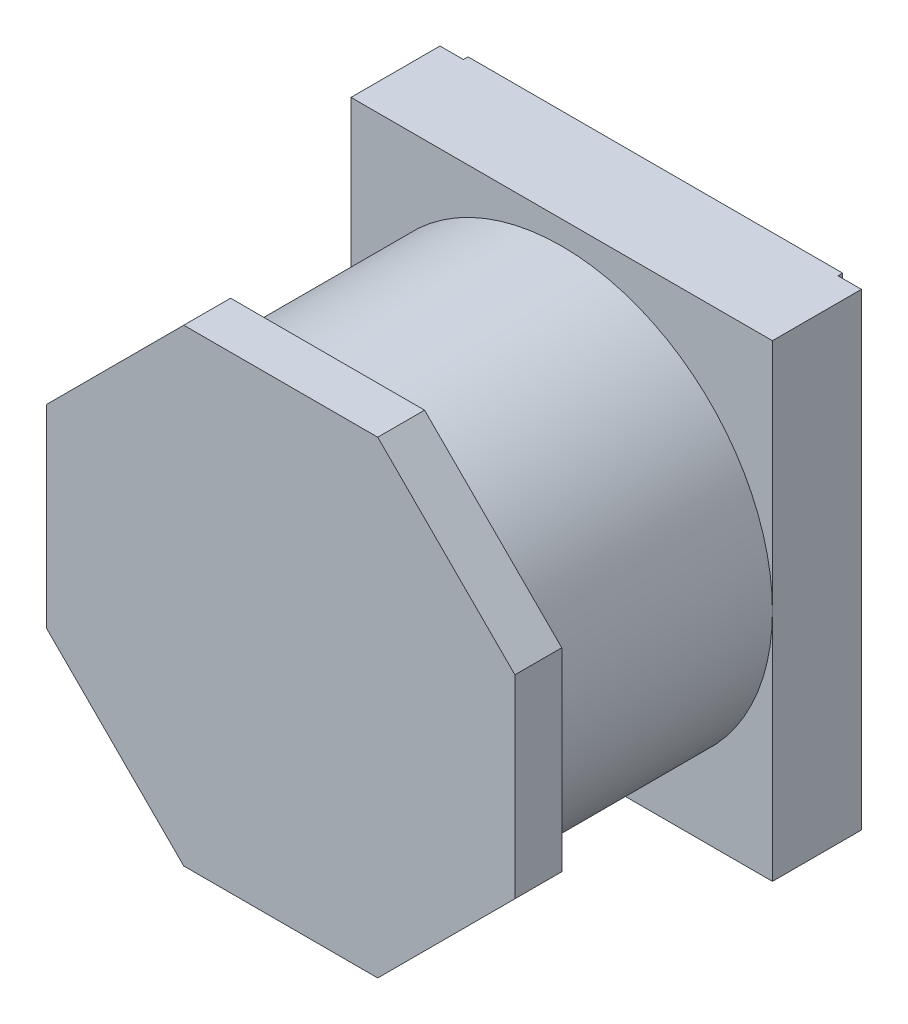
ISO-10303-21;
HEADER;
FILE_DESCRIPTION(('STEP AP214'),'2;1');
FILE_NAME('part.step','',(''),(''),'','','');
FILE_SCHEMA(('AUTOMOTIVE_DESIGN { 1 0 10303 214 1 1 1 1 }'));
ENDSEC;
DATA;
#1=APPLICATION_CONTEXT('core data for automotive mechanical design processes');
#2=APPLICATION_PROTOCOL_DEFINITION('international standard','automotive_design',2000,#1);
#3=PRODUCT_CONTEXT('',#1,'mechanical');
#4=PRODUCT('Part','Part','',(#3));
#5=PRODUCT_RELATED_PRODUCT_CATEGORY('part','',(#4));
#6=PRODUCT_DEFINITION_FORMATION('','',#4);
#7=PRODUCT_DEFINITION_CONTEXT('part definition',#1,'design');
#8=PRODUCT_DEFINITION('design','',#6,#7);
#9=PRODUCT_DEFINITION_SHAPE('','',#8);
#10=(LENGTH_UNIT() NAMED_UNIT(*) SI_UNIT(.MILLI.,.METRE.));
#11=(NAMED_UNIT(*) PLANE_ANGLE_UNIT() SI_UNIT($,.RADIAN.));
#12=(NAMED_UNIT(*) SI_UNIT($,.STERADIAN.) SOLID_ANGLE_UNIT());
#13=UNCERTAINTY_MEASURE_WITH_UNIT(LENGTH_MEASURE(1.E-05),#10,'distance_accuracy_value','');
#14=(GEOMETRIC_REPRESENTATION_CONTEXT(3) GLOBAL_UNCERTAINTY_ASSIGNED_CONTEXT((#13)) GLOBAL_UNIT_ASSIGNED_CONTEXT((#10,
#11,#12)) REPRESENTATION_CONTEXT('',''));
#15=CARTESIAN_POINT('',(0.,0.,0.));
#16=DIRECTION('',(0.,0.,1.));
#17=DIRECTION('',(1.,0.,0.));
#18=AXIS2_PLACEMENT_3D('',#15,#16,#17);
#19=CARTESIAN_POINT('',(0.,0.,1.));
#20=DIRECTION('',(-1.,0.,0.));
#21=DIRECTION('',(0.,0.,1.));
#22=AXIS2_PLACEMENT_3D('',#19,#20,#21);
#23=PLANE('',#22);
#24=DIRECTION('',(0.,-1.,0.));
#25=VECTOR('',#24,1.);
#26=CARTESIAN_POINT('',(0.,5.,0.05));
#27=LINE('',#26,#25);
#28=CARTESIAN_POINT('',(0.,5.,0.05));
#29=VERTEX_POINT('',#28);
#30=CARTESIAN_POINT('',(0.,0.,0.05));
#31=VERTEX_POINT('',#30);
#32=EDGE_CURVE('E212',#29,#31,#27,.T.);
#33=ORIENTED_EDGE('',*,*,#32,.F.);
#34=DIRECTION('',(0.,0.,-1.));
#35=VECTOR('',#34,1.);
#36=CARTESIAN_POINT('',(0.,5.,1.));
#37=LINE('',#36,#35);
#38=CARTESIAN_POINT('',(0.,5.,1.));
#39=VERTEX_POINT('',#38);
#40=EDGE_CURVE('E211',#39,#29,#37,.T.);
#41=ORIENTED_EDGE('',*,*,#40,.F.);
#42=DIRECTION('',(0.,1.,0.));
#43=VECTOR('',#42,1.);
#44=CARTESIAN_POINT('',(0.,0.,1.));
#45=LINE('',#44,#43);
#46=CARTESIAN_POINT('',(0.,2.5,1.));
#47=VERTEX_POINT('',#46);
#48=EDGE_CURVE('E341',#47,#39,#45,.T.);
#49=ORIENTED_EDGE('',*,*,#48,.F.);
#50=CARTESIAN_POINT('',(0.,0.,1.));
#51=VERTEX_POINT('',#50);
#52=EDGE_CURVE('E342',#51,#47,#45,.T.);
#53=ORIENTED_EDGE('',*,*,#52,.F.);
#54=DIRECTION('',(0.,0.,-1.));
#55=VECTOR('',#54,1.);
#56=CARTESIAN_POINT('',(0.,0.,1.));
#57=LINE('',#56,#55);
#58=EDGE_CURVE('E49',#51,#31,#57,.T.);
#59=ORIENTED_EDGE('',*,*,#58,.T.);
#60=EDGE_LOOP('',(#33,#41,#49,#53,#59));
#61=FACE_BOUND('',#60,.T.);
#62=ADVANCED_FACE('F39',(#61),#23,.F.);
#63=CARTESIAN_POINT('',(-4.5,0.,1.));
#64=DIRECTION('',(-1.,0.,0.));
#65=DIRECTION('',(0.,0.,1.));
#66=AXIS2_PLACEMENT_3D('',#63,#64,#65);
#67=PLANE('',#66);
#68=DIRECTION('',(0.,0.,-1.));
#69=VECTOR('',#68,1.);
#70=CARTESIAN_POINT('',(-4.5,5.,1.));
#71=LINE('',#70,#69);
#72=CARTESIAN_POINT('',(-4.5,5.,1.));
#73=VERTEX_POINT('',#72);
#74=CARTESIAN_POINT('',(-4.5,5.,0.05));
#75=VERTEX_POINT('',#74);
#76=EDGE_CURVE('E349',#73,#75,#71,.T.);
#77=ORIENTED_EDGE('',*,*,#76,.T.);
#78=DIRECTION('',(0.,1.,0.));
#79=VECTOR('',#78,1.);
#80=CARTESIAN_POINT('',(-4.5,0.,0.05));
#81=LINE('',#80,#79);
#82=CARTESIAN_POINT('',(-4.5,0.,0.05));
#83=VERTEX_POINT('',#82);
#84=EDGE_CURVE('E230',#83,#75,#81,.T.);
#85=ORIENTED_EDGE('',*,*,#84,.F.);
#86=DIRECTION('',(0.,0.,-1.));
#87=VECTOR('',#86,1.);
#88=CARTESIAN_POINT('',(-4.5,0.,1.));
#89=LINE('',#88,#87);
#90=CARTESIAN_POINT('',(-4.5,0.,1.));
#91=VERTEX_POINT('',#90);
#92=EDGE_CURVE('E43',#91,#83,#89,.T.);
#93=ORIENTED_EDGE('',*,*,#92,.F.);
#94=DIRECTION('',(0.,1.,0.));
#95=VECTOR('',#94,1.);
#96=CARTESIAN_POINT('',(-4.5,0.,1.));
#97=LINE('',#96,#95);
#98=CARTESIAN_POINT('',(-4.5,2.5,1.));
#99=VERTEX_POINT('',#98);
#100=EDGE_CURVE('E334',#91,#99,#97,.T.);
#101=ORIENTED_EDGE('',*,*,#100,.T.);
#102=EDGE_CURVE('E332',#99,#73,#97,.T.);
#103=ORIENTED_EDGE('',*,*,#102,.T.);
#104=EDGE_LOOP('',(#77,#85,#93,#101,#103));
#105=FACE_BOUND('',#104,.T.);
#106=ADVANCED_FACE('F358',(#105),#67,.T.);
#107=CARTESIAN_POINT('',(0.,0.,0.));
#108=DIRECTION('',(0.,0.,-1.));
#109=DIRECTION('',(-1.,0.,0.));
#110=AXIS2_PLACEMENT_3D('',#107,#108,#109);
#111=PLANE('',#110);
#112=DIRECTION('',(0.,1.,0.));
#113=VECTOR('',#112,1.);
#114=CARTESIAN_POINT('',(-0.249999999999999,5.,0.));
#115=LINE('',#114,#113);
#116=CARTESIAN_POINT('',(-0.249999999999999,3.75,0.));
#117=VERTEX_POINT('',#116);
#118=CARTESIAN_POINT('',(-0.249999999999999,5.,0.));
#119=VERTEX_POINT('',#118);
#120=EDGE_CURVE('E192',#117,#119,#115,.T.);
#121=ORIENTED_EDGE('',*,*,#120,.F.);
#122=DIRECTION('',(1.,0.,0.));
#123=VECTOR('',#122,1.);
#124=CARTESIAN_POINT('',(-0.249999999999999,3.75,0.));
#125=LINE('',#124,#123);
#126=CARTESIAN_POINT('',(-4.25,3.75,0.));
#127=VERTEX_POINT('',#126);
#128=EDGE_CURVE('E205',#127,#117,#125,.T.);
#129=ORIENTED_EDGE('',*,*,#128,.F.);
#130=DIRECTION('',(0.,-1.,0.));
#131=VECTOR('',#130,1.);
#132=CARTESIAN_POINT('',(-4.25,5.,0.));
#133=LINE('',#132,#131);
#134=CARTESIAN_POINT('',(-4.25,5.,0.));
#135=VERTEX_POINT('',#134);
#136=EDGE_CURVE('E246',#135,#127,#133,.T.);
#137=ORIENTED_EDGE('',*,*,#136,.F.);
#138=DIRECTION('',(-1.,0.,0.));
#139=VECTOR('',#138,1.);
#140=CARTESIAN_POINT('',(0.,5.,0.));
#141=LINE('',#140,#139);
#142=EDGE_CURVE('E333',#119,#135,#141,.T.);
#143=ORIENTED_EDGE('',*,*,#142,.F.);
#144=EDGE_LOOP('',(#121,#129,#137,#143));
#145=FACE_BOUND('',#144,.T.);
#146=ADVANCED_FACE('F382',(#145),#111,.T.);
#147=CARTESIAN_POINT('',(0.,0.,1.));
#148=DIRECTION('',(0.,0.,-1.));
#149=DIRECTION('',(-1.,0.,0.));
#150=AXIS2_PLACEMENT_3D('',#147,#148,#149);
#151=PLANE('',#150);
#152=CARTESIAN_POINT('',(-2.25,2.5,1.));
#153=DIRECTION('',(0.,0.,1.));
#154=DIRECTION('',(1.,0.,0.));
#155=AXIS2_PLACEMENT_3D('',#152,#153,#154);
#156=CIRCLE('',#155,2.25);
#157=EDGE_CURVE('E51',#47,#99,#156,.T.);
#158=ORIENTED_EDGE('',*,*,#157,.F.);
#159=ORIENTED_EDGE('',*,*,#48,.T.);
#160=DIRECTION('',(-1.,0.,0.));
#161=VECTOR('',#160,1.);
#162=CARTESIAN_POINT('',(0.,5.,1.));
#163=LINE('',#162,#161);
#164=EDGE_CURVE('E338',#39,#73,#163,.T.);
#165=ORIENTED_EDGE('',*,*,#164,.T.);
#166=ORIENTED_EDGE('',*,*,#102,.F.);
#167=EDGE_LOOP('',(#158,#159,#165,#166));
#168=FACE_BOUND('',#167,.T.);
#169=ADVANCED_FACE('F365',(#168),#151,.F.);
#170=EDGE_CURVE('E11',#99,#47,#156,.T.);
#171=ORIENTED_EDGE('',*,*,#170,.F.);
#172=ORIENTED_EDGE('',*,*,#100,.F.);
#173=DIRECTION('',(-1.,0.,0.));
#174=VECTOR('',#173,1.);
#175=CARTESIAN_POINT('',(0.,0.,1.));
#176=LINE('',#175,#174);
#177=EDGE_CURVE('E329',#51,#91,#176,.T.);
#178=ORIENTED_EDGE('',*,*,#177,.F.);
#179=ORIENTED_EDGE('',*,*,#52,.T.);
#180=EDGE_LOOP('',(#171,#172,#178,#179));
#181=FACE_BOUND('',#180,.T.);
#182=ADVANCED_FACE('F359',(#181),#151,.F.);
#183=CARTESIAN_POINT('',(0.,0.,1.));
#184=DIRECTION('',(0.,-1.,0.));
#185=DIRECTION('',(0.,0.,-1.));
#186=AXIS2_PLACEMENT_3D('',#183,#184,#185);
#187=PLANE('',#186);
#188=DIRECTION('',(0.,0.,-1.));
#189=VECTOR('',#188,1.);
#190=CARTESIAN_POINT('',(-4.25,0.,0.05));
#191=LINE('',#190,#189);
#192=CARTESIAN_POINT('',(-4.25,0.,0.05));
#193=VERTEX_POINT('',#192);
#194=CARTESIAN_POINT('',(-4.25,0.,0.));
#195=VERTEX_POINT('',#194);
#196=EDGE_CURVE('E258',#193,#195,#191,.T.);
#197=ORIENTED_EDGE('',*,*,#196,.T.);
#198=DIRECTION('',(-1.,0.,0.));
#199=VECTOR('',#198,1.);
#200=CARTESIAN_POINT('',(0.,0.,0.));
#201=LINE('',#200,#199);
#202=CARTESIAN_POINT('',(-0.249999999999999,0.,0.));
#203=VERTEX_POINT('',#202);
#204=EDGE_CURVE('E326',#203,#195,#201,.T.);
#205=ORIENTED_EDGE('',*,*,#204,.F.);
#206=DIRECTION('',(0.,0.,-1.));
#207=VECTOR('',#206,1.);
#208=CARTESIAN_POINT('',(-0.249999999999999,0.,0.05));
#209=LINE('',#208,#207);
#210=CARTESIAN_POINT('',(-0.249999999999999,0.,0.05));
#211=VERTEX_POINT('',#210);
#212=EDGE_CURVE('E58',#211,#203,#209,.T.);
#213=ORIENTED_EDGE('',*,*,#212,.F.);
#214=DIRECTION('',(-1.,0.,0.));
#215=VECTOR('',#214,1.);
#216=CARTESIAN_POINT('',(0.,0.,0.05));
#217=LINE('',#216,#215);
#218=EDGE_CURVE('E214',#31,#211,#217,.T.);
#219=ORIENTED_EDGE('',*,*,#218,.F.);
#220=ORIENTED_EDGE('',*,*,#58,.F.);
#221=ORIENTED_EDGE('',*,*,#177,.T.);
#222=ORIENTED_EDGE('',*,*,#92,.T.);
#223=DIRECTION('',(-1.,0.,0.));
#224=VECTOR('',#223,1.);
#225=CARTESIAN_POINT('',(-4.25,0.,0.05));
#226=LINE('',#225,#224);
#227=EDGE_CURVE('E228',#193,#83,#226,.T.);
#228=ORIENTED_EDGE('',*,*,#227,.F.);
#229=EDGE_LOOP('',(#197,#205,#213,#219,#220,#221,#222,#228));
#230=FACE_BOUND('',#229,.T.);
#231=ADVANCED_FACE('F41',(#230),#187,.T.);
#232=CARTESIAN_POINT('',(0.,5.,1.));
#233=DIRECTION('',(0.,-1.,0.));
#234=DIRECTION('',(1.,0.,0.));
#235=AXIS2_PLACEMENT_3D('',#232,#233,#234);
#236=PLANE('',#235);
#237=ORIENTED_EDGE('',*,*,#142,.T.);
#238=DIRECTION('',(0.,0.,-1.));
#239=VECTOR('',#238,1.);
#240=CARTESIAN_POINT('',(-4.25,5.,0.05));
#241=LINE('',#240,#239);
#242=CARTESIAN_POINT('',(-4.25,5.,0.05));
#243=VERTEX_POINT('',#242);
#244=EDGE_CURVE('E256',#243,#135,#241,.T.);
#245=ORIENTED_EDGE('',*,*,#244,.F.);
#246=DIRECTION('',(1.,0.,0.));
#247=VECTOR('',#246,1.);
#248=CARTESIAN_POINT('',(-4.5,5.,0.05));
#249=LINE('',#248,#247);
#250=EDGE_CURVE('E232',#75,#243,#249,.T.);
#251=ORIENTED_EDGE('',*,*,#250,.F.);
#252=ORIENTED_EDGE('',*,*,#76,.F.);
#253=ORIENTED_EDGE('',*,*,#164,.F.);
#254=ORIENTED_EDGE('',*,*,#40,.T.);
#255=DIRECTION('',(1.,0.,0.));
#256=VECTOR('',#255,1.);
#257=CARTESIAN_POINT('',(-0.249999999999999,5.,0.05));
#258=LINE('',#257,#256);
#259=CARTESIAN_POINT('',(-0.249999999999999,5.,0.05));
#260=VERTEX_POINT('',#259);
#261=EDGE_CURVE('E201',#260,#29,#258,.T.);
#262=ORIENTED_EDGE('',*,*,#261,.F.);
#263=DIRECTION('',(0.,0.,-1.));
#264=VECTOR('',#263,1.);
#265=CARTESIAN_POINT('',(-0.249999999999999,5.,0.05));
#266=LINE('',#265,#264);
#267=EDGE_CURVE('E186',#260,#119,#266,.T.);
#268=ORIENTED_EDGE('',*,*,#267,.T.);
#269=EDGE_LOOP('',(#237,#245,#251,#252,#253,#254,#262,#268));
#270=FACE_BOUND('',#269,.T.);
#271=ADVANCED_FACE('F208',(#270),#236,.F.);
#272=DIRECTION('',(0.,-1.,0.));
#273=VECTOR('',#272,1.);
#274=CARTESIAN_POINT('',(-4.25,0.,0.));
#275=LINE('',#274,#273);
#276=CARTESIAN_POINT('',(-4.25,1.25,0.));
#277=VERTEX_POINT('',#276);
#278=EDGE_CURVE('E244',#277,#195,#275,.T.);
#279=ORIENTED_EDGE('',*,*,#278,.F.);
#280=DIRECTION('',(-1.,0.,0.));
#281=VECTOR('',#280,1.);
#282=CARTESIAN_POINT('',(-0.25,1.25,0.));
#283=LINE('',#282,#281);
#284=CARTESIAN_POINT('',(-0.25,1.25,0.));
#285=VERTEX_POINT('',#284);
#286=EDGE_CURVE('E241',#285,#277,#283,.T.);
#287=ORIENTED_EDGE('',*,*,#286,.F.);
#288=DIRECTION('',(0.,1.,0.));
#289=VECTOR('',#288,1.);
#290=CARTESIAN_POINT('',(-0.249999999999999,0.,0.));
#291=LINE('',#290,#289);
#292=EDGE_CURVE('E239',#203,#285,#291,.T.);
#293=ORIENTED_EDGE('',*,*,#292,.F.);
#294=ORIENTED_EDGE('',*,*,#204,.T.);
#295=EDGE_LOOP('',(#279,#287,#293,#294));
#296=FACE_BOUND('',#295,.T.);
#297=ADVANCED_FACE('F370',(#296),#111,.T.);
#298=CARTESIAN_POINT('',(-2.25,2.5,3.5));
#299=DIRECTION('',(0.,0.,-1.));
#300=DIRECTION('',(-1.,0.,0.));
#301=AXIS2_PLACEMENT_3D('',#298,#299,#300);
#302=CYLINDRICAL_SURFACE('',#301,2.25);
#303=CARTESIAN_POINT('',(-2.25,2.5,3.5));
#304=DIRECTION('',(0.,0.,1.));
#305=DIRECTION('',(1.,0.,0.));
#306=AXIS2_PLACEMENT_3D('',#303,#304,#305);
#307=CIRCLE('',#306,2.25);
#308=CARTESIAN_POINT('',(0.,2.5,3.5));
#309=VERTEX_POINT('',#308);
#310=EDGE_CURVE('E324',#309,#309,#307,.T.);
#311=ORIENTED_EDGE('',*,*,#310,.F.);
#312=EDGE_LOOP('',(#311));
#313=FACE_BOUND('',#312,.T.);
#314=ORIENTED_EDGE('',*,*,#157,.T.);
#315=ORIENTED_EDGE('',*,*,#170,.T.);
#316=EDGE_LOOP('',(#314,#315));
#317=FACE_BOUND('',#316,.T.);
#318=ADVANCED_FACE('F367',(#313,#317),#302,.T.);
#319=CARTESIAN_POINT('',(0.,0.,3.5));
#320=DIRECTION('',(0.,0.,1.));
#321=DIRECTION('',(1.,0.,0.));
#322=AXIS2_PLACEMENT_3D('',#319,#320,#321);
#323=PLANE('',#322);
#324=DIRECTION('',(-0.707106781186548,0.707106781186548,0.));
#325=VECTOR('',#324,1.);
#326=CARTESIAN_POINT('',(0.250353186444832,3.53568020054823,3.5));
#327=LINE('',#326,#325);
#328=CARTESIAN_POINT('',(0.250353186444832,3.53568020054823,3.5));
#329=VERTEX_POINT('',#328);
#330=CARTESIAN_POINT('',(-1.21431979945177,5.00035318644483,3.5));
#331=VERTEX_POINT('',#330);
#332=EDGE_CURVE('E253',#329,#331,#327,.T.);
#333=ORIENTED_EDGE('',*,*,#332,.F.);
#334=DIRECTION('',(0.,1.,0.));
#335=VECTOR('',#334,1.);
#336=CARTESIAN_POINT('',(0.250353186444832,1.46431979945177,3.5));
#337=LINE('',#336,#335);
#338=CARTESIAN_POINT('',(0.250353186444832,1.46431979945177,3.5));
#339=VERTEX_POINT('',#338);
#340=EDGE_CURVE('E270',#339,#329,#337,.T.);
#341=ORIENTED_EDGE('',*,*,#340,.F.);
#342=DIRECTION('',(0.707106781186547,0.707106781186548,0.));
#343=VECTOR('',#342,1.);
#344=CARTESIAN_POINT('',(-1.21431979945177,-0.00035318644483175,3.5));
#345=LINE('',#344,#343);
#346=CARTESIAN_POINT('',(-1.21431979945177,-0.00035318644483175,3.5));
#347=VERTEX_POINT('',#346);
#348=EDGE_CURVE('E297',#347,#339,#345,.T.);
#349=ORIENTED_EDGE('',*,*,#348,.F.);
#350=DIRECTION('',(1.,0.,0.));
#351=VECTOR('',#350,1.);
#352=CARTESIAN_POINT('',(-3.28568020054823,-0.000353186444832258,3.5));
#353=LINE('',#352,#351);
#354=CARTESIAN_POINT('',(-3.28568020054823,-0.000353186444832258,3.5));
#355=VERTEX_POINT('',#354);
#356=EDGE_CURVE('E295',#355,#347,#353,.T.);
#357=ORIENTED_EDGE('',*,*,#356,.F.);
#358=DIRECTION('',(0.707106781186548,-0.707106781186547,0.));
#359=VECTOR('',#358,1.);
#360=CARTESIAN_POINT('',(-4.75035318644483,1.46431979945177,3.5));
#361=LINE('',#360,#359);
#362=CARTESIAN_POINT('',(-4.75035318644483,1.46431979945177,3.5));
#363=VERTEX_POINT('',#362);
#364=EDGE_CURVE('E293',#363,#355,#361,.T.);
#365=ORIENTED_EDGE('',*,*,#364,.F.);
#366=DIRECTION('',(0.,-1.,0.));
#367=VECTOR('',#366,1.);
#368=CARTESIAN_POINT('',(-4.75035318644483,3.53568020054823,3.5));
#369=LINE('',#368,#367);
#370=CARTESIAN_POINT('',(-4.75035318644483,3.53568020054823,3.5));
#371=VERTEX_POINT('',#370);
#372=EDGE_CURVE('E291',#371,#363,#369,.T.);
#373=ORIENTED_EDGE('',*,*,#372,.F.);
#374=DIRECTION('',(-0.707106781186547,-0.707106781186548,0.));
#375=VECTOR('',#374,1.);
#376=CARTESIAN_POINT('',(-3.28568020054823,5.00035318644483,3.5));
#377=LINE('',#376,#375);
#378=CARTESIAN_POINT('',(-3.28568020054823,5.00035318644483,3.5));
#379=VERTEX_POINT('',#378);
#380=EDGE_CURVE('E289',#379,#371,#377,.T.);
#381=ORIENTED_EDGE('',*,*,#380,.F.);
#382=DIRECTION('',(-1.,0.,0.));
#383=VECTOR('',#382,1.);
#384=CARTESIAN_POINT('',(-1.21431979945177,5.00035318644483,3.5));
#385=LINE('',#384,#383);
#386=EDGE_CURVE('E287',#331,#379,#385,.T.);
#387=ORIENTED_EDGE('',*,*,#386,.F.);
#388=EDGE_LOOP('',(#333,#341,#349,#357,#365,#373,#381,#387));
#389=FACE_BOUND('',#388,.T.);
#390=ORIENTED_EDGE('',*,*,#310,.T.);
#391=EDGE_LOOP('',(#390));
#392=FACE_BOUND('',#391,.T.);
#393=ADVANCED_FACE('F369',(#389,#392),#323,.F.);
#394=CARTESIAN_POINT('',(0.250353186444832,3.53568020054823,4.));
#395=DIRECTION('',(-0.707106781186547,-0.707106781186548,0.));
#396=DIRECTION('',(0.707106781186548,-0.707106781186547,0.));
#397=AXIS2_PLACEMENT_3D('',#394,#395,#396);
#398=PLANE('',#397);
#399=ORIENTED_EDGE('',*,*,#332,.T.);
#400=DIRECTION('',(0.,0.,-1.));
#401=VECTOR('',#400,1.);
#402=CARTESIAN_POINT('',(-1.21431979945177,5.00035318644483,4.));
#403=LINE('',#402,#401);
#404=CARTESIAN_POINT('',(-1.21431979945177,5.00035318644483,4.));
#405=VERTEX_POINT('',#404);
#406=EDGE_CURVE('E321',#405,#331,#403,.T.);
#407=ORIENTED_EDGE('',*,*,#406,.F.);
#408=DIRECTION('',(-0.707106781186548,0.707106781186548,0.));
#409=VECTOR('',#408,1.);
#410=CARTESIAN_POINT('',(0.250353186444832,3.53568020054823,4.));
#411=LINE('',#410,#409);
#412=CARTESIAN_POINT('',(0.250353186444832,3.53568020054823,4.));
#413=VERTEX_POINT('',#412);
#414=EDGE_CURVE('E266',#413,#405,#411,.T.);
#415=ORIENTED_EDGE('',*,*,#414,.F.);
#416=DIRECTION('',(0.,0.,-1.));
#417=VECTOR('',#416,1.);
#418=CARTESIAN_POINT('',(0.250353186444832,3.53568020054823,4.));
#419=LINE('',#418,#417);
#420=EDGE_CURVE('E284',#413,#329,#419,.T.);
#421=ORIENTED_EDGE('',*,*,#420,.T.);
#422=EDGE_LOOP('',(#399,#407,#415,#421));
#423=FACE_BOUND('',#422,.T.);
#424=ADVANCED_FACE('F377',(#423),#398,.F.);
#425=CARTESIAN_POINT('',(-1.21431979945177,5.00035318644483,4.));
#426=DIRECTION('',(0.,-1.,0.));
#427=DIRECTION('',(0.,0.,-1.));
#428=AXIS2_PLACEMENT_3D('',#425,#426,#427);
#429=PLANE('',#428);
#430=ORIENTED_EDGE('',*,*,#386,.T.);
#431=DIRECTION('',(0.,0.,-1.));
#432=VECTOR('',#431,1.);
#433=CARTESIAN_POINT('',(-3.28568020054823,5.00035318644483,4.));
#434=LINE('',#433,#432);
#435=CARTESIAN_POINT('',(-3.28568020054823,5.00035318644483,4.));
#436=VERTEX_POINT('',#435);
#437=EDGE_CURVE('E318',#436,#379,#434,.T.);
#438=ORIENTED_EDGE('',*,*,#437,.F.);
#439=DIRECTION('',(-1.,0.,0.));
#440=VECTOR('',#439,1.);
#441=CARTESIAN_POINT('',(-1.21431979945177,5.00035318644483,4.));
#442=LINE('',#441,#440);
#443=EDGE_CURVE('E269',#405,#436,#442,.T.);
#444=ORIENTED_EDGE('',*,*,#443,.F.);
#445=ORIENTED_EDGE('',*,*,#406,.T.);
#446=EDGE_LOOP('',(#430,#438,#444,#445));
#447=FACE_BOUND('',#446,.T.);
#448=ADVANCED_FACE('F465',(#447),#429,.F.);
#449=CARTESIAN_POINT('',(-3.28568020054823,5.00035318644483,4.));
#450=DIRECTION('',(0.707106781186548,-0.707106781186547,0.));
#451=DIRECTION('',(0.707106781186547,0.707106781186548,0.));
#452=AXIS2_PLACEMENT_3D('',#449,#450,#451);
#453=PLANE('',#452);
#454=ORIENTED_EDGE('',*,*,#380,.T.);
#455=DIRECTION('',(0.,0.,-1.));
#456=VECTOR('',#455,1.);
#457=CARTESIAN_POINT('',(-4.75035318644483,3.53568020054823,4.));
#458=LINE('',#457,#456);
#459=CARTESIAN_POINT('',(-4.75035318644483,3.53568020054823,4.));
#460=VERTEX_POINT('',#459);
#461=EDGE_CURVE('E315',#460,#371,#458,.T.);
#462=ORIENTED_EDGE('',*,*,#461,.F.);
#463=DIRECTION('',(-0.707106781186547,-0.707106781186548,0.));
#464=VECTOR('',#463,1.);
#465=CARTESIAN_POINT('',(-3.28568020054823,5.00035318644483,4.));
#466=LINE('',#465,#464);
#467=EDGE_CURVE('E272',#436,#460,#466,.T.);
#468=ORIENTED_EDGE('',*,*,#467,.F.);
#469=ORIENTED_EDGE('',*,*,#437,.T.);
#470=EDGE_LOOP('',(#454,#462,#468,#469));
#471=FACE_BOUND('',#470,.T.);
#472=ADVANCED_FACE('F461',(#471),#453,.F.);
#473=CARTESIAN_POINT('',(-4.75035318644483,3.53568020054823,4.));
#474=DIRECTION('',(1.,0.,0.));
#475=DIRECTION('',(0.,1.,0.));
#476=AXIS2_PLACEMENT_3D('',#473,#474,#475);
#477=PLANE('',#476);
#478=ORIENTED_EDGE('',*,*,#372,.T.);
#479=DIRECTION('',(0.,0.,-1.));
#480=VECTOR('',#479,1.);
#481=CARTESIAN_POINT('',(-4.75035318644483,1.46431979945177,4.));
#482=LINE('',#481,#480);
#483=CARTESIAN_POINT('',(-4.75035318644483,1.46431979945177,4.));
#484=VERTEX_POINT('',#483);
#485=EDGE_CURVE('E312',#484,#363,#482,.T.);
#486=ORIENTED_EDGE('',*,*,#485,.F.);
#487=DIRECTION('',(0.,-1.,0.));
#488=VECTOR('',#487,1.);
#489=CARTESIAN_POINT('',(-4.75035318644483,3.53568020054823,4.));
#490=LINE('',#489,#488);
#491=EDGE_CURVE('E274',#460,#484,#490,.T.);
#492=ORIENTED_EDGE('',*,*,#491,.F.);
#493=ORIENTED_EDGE('',*,*,#461,.T.);
#494=EDGE_LOOP('',(#478,#486,#492,#493));
#495=FACE_BOUND('',#494,.T.);
#496=ADVANCED_FACE('F457',(#495),#477,.F.);
#497=CARTESIAN_POINT('',(-4.75035318644483,1.46431979945177,4.));
#498=DIRECTION('',(0.707106781186547,0.707106781186548,0.));
#499=DIRECTION('',(-0.707106781186548,0.707106781186547,0.));
#500=AXIS2_PLACEMENT_3D('',#497,#498,#499);
#501=PLANE('',#500);
#502=ORIENTED_EDGE('',*,*,#364,.T.);
#503=DIRECTION('',(0.,0.,-1.));
#504=VECTOR('',#503,1.);
#505=CARTESIAN_POINT('',(-3.28568020054823,-0.000353186444832258,4.));
#506=LINE('',#505,#504);
#507=CARTESIAN_POINT('',(-3.28568020054823,-0.000353186444832258,4.));
#508=VERTEX_POINT('',#507);
#509=EDGE_CURVE('E309',#508,#355,#506,.T.);
#510=ORIENTED_EDGE('',*,*,#509,.F.);
#511=DIRECTION('',(0.707106781186548,-0.707106781186547,0.));
#512=VECTOR('',#511,1.);
#513=CARTESIAN_POINT('',(-4.75035318644483,1.46431979945177,4.));
#514=LINE('',#513,#512);
#515=EDGE_CURVE('E276',#484,#508,#514,.T.);
#516=ORIENTED_EDGE('',*,*,#515,.F.);
#517=ORIENTED_EDGE('',*,*,#485,.T.);
#518=EDGE_LOOP('',(#502,#510,#516,#517));
#519=FACE_BOUND('',#518,.T.);
#520=ADVANCED_FACE('F453',(#519),#501,.F.);
#521=CARTESIAN_POINT('',(-3.28568020054823,-0.000353186444832258,4.));
#522=DIRECTION('',(0.,1.,0.));
#523=DIRECTION('',(-1.,0.,0.));
#524=AXIS2_PLACEMENT_3D('',#521,#522,#523);
#525=PLANE('',#524);
#526=ORIENTED_EDGE('',*,*,#356,.T.);
#527=DIRECTION('',(0.,0.,-1.));
#528=VECTOR('',#527,1.);
#529=CARTESIAN_POINT('',(-1.21431979945177,-0.00035318644483175,4.));
#530=LINE('',#529,#528);
#531=CARTESIAN_POINT('',(-1.21431979945177,-0.00035318644483175,4.));
#532=VERTEX_POINT('',#531);
#533=EDGE_CURVE('E306',#532,#347,#530,.T.);
#534=ORIENTED_EDGE('',*,*,#533,.F.);
#535=DIRECTION('',(1.,0.,0.));
#536=VECTOR('',#535,1.);
#537=CARTESIAN_POINT('',(-3.28568020054823,-0.000353186444832258,4.));
#538=LINE('',#537,#536);
#539=EDGE_CURVE('E278',#508,#532,#538,.T.);
#540=ORIENTED_EDGE('',*,*,#539,.F.);
#541=ORIENTED_EDGE('',*,*,#509,.T.);
#542=EDGE_LOOP('',(#526,#534,#540,#541));
#543=FACE_BOUND('',#542,.T.);
#544=ADVANCED_FACE('F449',(#543),#525,.F.);
#545=CARTESIAN_POINT('',(-1.21431979945177,-0.00035318644483175,4.));
#546=DIRECTION('',(-0.707106781186548,0.707106781186547,0.));
#547=DIRECTION('',(-0.707106781186547,-0.707106781186548,0.));
#548=AXIS2_PLACEMENT_3D('',#545,#546,#547);
#549=PLANE('',#548);
#550=ORIENTED_EDGE('',*,*,#348,.T.);
#551=DIRECTION('',(0.,0.,-1.));
#552=VECTOR('',#551,1.);
#553=CARTESIAN_POINT('',(0.250353186444832,1.46431979945177,4.));
#554=LINE('',#553,#552);
#555=CARTESIAN_POINT('',(0.250353186444832,1.46431979945177,4.));
#556=VERTEX_POINT('',#555);
#557=EDGE_CURVE('E303',#556,#339,#554,.T.);
#558=ORIENTED_EDGE('',*,*,#557,.F.);
#559=DIRECTION('',(0.707106781186547,0.707106781186548,0.));
#560=VECTOR('',#559,1.);
#561=CARTESIAN_POINT('',(-1.21431979945177,-0.00035318644483175,4.));
#562=LINE('',#561,#560);
#563=EDGE_CURVE('E280',#532,#556,#562,.T.);
#564=ORIENTED_EDGE('',*,*,#563,.F.);
#565=ORIENTED_EDGE('',*,*,#533,.T.);
#566=EDGE_LOOP('',(#550,#558,#564,#565));
#567=FACE_BOUND('',#566,.T.);
#568=ADVANCED_FACE('F445',(#567),#549,.F.);
#569=CARTESIAN_POINT('',(0.250353186444832,1.46431979945177,4.));
#570=DIRECTION('',(-1.,0.,0.));
#571=DIRECTION('',(0.,-1.,0.));
#572=AXIS2_PLACEMENT_3D('',#569,#570,#571);
#573=PLANE('',#572);
#574=ORIENTED_EDGE('',*,*,#340,.T.);
#575=ORIENTED_EDGE('',*,*,#420,.F.);
#576=DIRECTION('',(0.,1.,0.));
#577=VECTOR('',#576,1.);
#578=CARTESIAN_POINT('',(0.250353186444832,1.46431979945177,4.));
#579=LINE('',#578,#577);
#580=EDGE_CURVE('E282',#556,#413,#579,.T.);
#581=ORIENTED_EDGE('',*,*,#580,.F.);
#582=ORIENTED_EDGE('',*,*,#557,.T.);
#583=EDGE_LOOP('',(#574,#575,#581,#582));
#584=FACE_BOUND('',#583,.T.);
#585=ADVANCED_FACE('F440',(#584),#573,.F.);
#586=CARTESIAN_POINT('',(0.,0.,4.));
#587=DIRECTION('',(0.,0.,1.));
#588=DIRECTION('',(1.,0.,0.));
#589=AXIS2_PLACEMENT_3D('',#586,#587,#588);
#590=PLANE('',#589);
#591=ORIENTED_EDGE('',*,*,#414,.T.);
#592=ORIENTED_EDGE('',*,*,#443,.T.);
#593=ORIENTED_EDGE('',*,*,#467,.T.);
#594=ORIENTED_EDGE('',*,*,#491,.T.);
#595=ORIENTED_EDGE('',*,*,#515,.T.);
#596=ORIENTED_EDGE('',*,*,#539,.T.);
#597=ORIENTED_EDGE('',*,*,#563,.T.);
#598=ORIENTED_EDGE('',*,*,#580,.T.);
#599=EDGE_LOOP('',(#591,#592,#593,#594,#595,#596,#597,#598));
#600=FACE_BOUND('',#599,.T.);
#601=ADVANCED_FACE('F438',(#600),#590,.T.);
#602=CARTESIAN_POINT('',(-0.249999999999999,5.,0.05));
#603=DIRECTION('',(-1.,0.,0.));
#604=DIRECTION('',(0.,0.,1.));
#605=AXIS2_PLACEMENT_3D('',#602,#603,#604);
#606=PLANE('',#605);
#607=ORIENTED_EDGE('',*,*,#120,.T.);
#608=ORIENTED_EDGE('',*,*,#267,.F.);
#609=DIRECTION('',(0.,1.,0.));
#610=VECTOR('',#609,1.);
#611=CARTESIAN_POINT('',(-0.249999999999999,5.,0.05));
#612=LINE('',#611,#610);
#613=CARTESIAN_POINT('',(-0.249999999999999,3.75,0.05));
#614=VERTEX_POINT('',#613);
#615=EDGE_CURVE('E189',#614,#260,#612,.T.);
#616=ORIENTED_EDGE('',*,*,#615,.F.);
#617=DIRECTION('',(0.,0.,-1.));
#618=VECTOR('',#617,1.);
#619=CARTESIAN_POINT('',(-0.249999999999999,3.75,0.05));
#620=LINE('',#619,#618);
#621=EDGE_CURVE('E251',#614,#117,#620,.T.);
#622=ORIENTED_EDGE('',*,*,#621,.T.);
#623=EDGE_LOOP('',(#607,#608,#616,#622));
#624=FACE_BOUND('',#623,.T.);
#625=ADVANCED_FACE('F188',(#624),#606,.F.);
#626=CARTESIAN_POINT('',(-0.249999999999999,3.75,0.05));
#627=DIRECTION('',(0.,1.,0.));
#628=DIRECTION('',(0.,0.,1.));
#629=AXIS2_PLACEMENT_3D('',#626,#627,#628);
#630=PLANE('',#629);
#631=ORIENTED_EDGE('',*,*,#128,.T.);
#632=ORIENTED_EDGE('',*,*,#621,.F.);
#633=DIRECTION('',(1.,0.,0.));
#634=VECTOR('',#633,1.);
#635=CARTESIAN_POINT('',(-0.249999999999999,3.75,0.05));
#636=LINE('',#635,#634);
#637=CARTESIAN_POINT('',(-4.25,3.75,0.05));
#638=VERTEX_POINT('',#637);
#639=EDGE_CURVE('E197',#638,#614,#636,.T.);
#640=ORIENTED_EDGE('',*,*,#639,.F.);
#641=DIRECTION('',(0.,0.,-1.));
#642=VECTOR('',#641,1.);
#643=CARTESIAN_POINT('',(-4.25,3.75,0.05));
#644=LINE('',#643,#642);
#645=EDGE_CURVE('E254',#638,#127,#644,.T.);
#646=ORIENTED_EDGE('',*,*,#645,.T.);
#647=EDGE_LOOP('',(#631,#632,#640,#646));
#648=FACE_BOUND('',#647,.T.);
#649=ADVANCED_FACE('F437',(#648),#630,.F.);
#650=CARTESIAN_POINT('',(-4.25,5.,0.05));
#651=DIRECTION('',(1.,0.,0.));
#652=DIRECTION('',(0.,0.,-1.));
#653=AXIS2_PLACEMENT_3D('',#650,#651,#652);
#654=PLANE('',#653);
#655=ORIENTED_EDGE('',*,*,#136,.T.);
#656=ORIENTED_EDGE('',*,*,#645,.F.);
#657=DIRECTION('',(0.,-1.,0.));
#658=VECTOR('',#657,1.);
#659=CARTESIAN_POINT('',(-4.25,5.,0.05));
#660=LINE('',#659,#658);
#661=EDGE_CURVE('E235',#243,#638,#660,.T.);
#662=ORIENTED_EDGE('',*,*,#661,.F.);
#663=ORIENTED_EDGE('',*,*,#244,.T.);
#664=EDGE_LOOP('',(#655,#656,#662,#663));
#665=FACE_BOUND('',#664,.T.);
#666=ADVANCED_FACE('F413',(#665),#654,.F.);
#667=CARTESIAN_POINT('',(-4.25,0.,0.05));
#668=DIRECTION('',(1.,0.,0.));
#669=DIRECTION('',(0.,1.,0.));
#670=AXIS2_PLACEMENT_3D('',#667,#668,#669);
#671=PLANE('',#670);
#672=ORIENTED_EDGE('',*,*,#278,.T.);
#673=ORIENTED_EDGE('',*,*,#196,.F.);
#674=DIRECTION('',(0.,-1.,0.));
#675=VECTOR('',#674,1.);
#676=CARTESIAN_POINT('',(-4.25,0.,0.05));
#677=LINE('',#676,#675);
#678=CARTESIAN_POINT('',(-4.25,1.25,0.05));
#679=VERTEX_POINT('',#678);
#680=EDGE_CURVE('E225',#679,#193,#677,.T.);
#681=ORIENTED_EDGE('',*,*,#680,.F.);
#682=DIRECTION('',(0.,0.,-1.));
#683=VECTOR('',#682,1.);
#684=CARTESIAN_POINT('',(-4.25,1.25,0.05));
#685=LINE('',#684,#683);
#686=EDGE_CURVE('E261',#679,#277,#685,.T.);
#687=ORIENTED_EDGE('',*,*,#686,.T.);
#688=EDGE_LOOP('',(#672,#673,#681,#687));
#689=FACE_BOUND('',#688,.T.);
#690=ADVANCED_FACE('F417',(#689),#671,.F.);
#691=CARTESIAN_POINT('',(-0.25,1.25,0.05));
#692=DIRECTION('',(0.,-1.,0.));
#693=DIRECTION('',(0.,0.,-1.));
#694=AXIS2_PLACEMENT_3D('',#691,#692,#693);
#695=PLANE('',#694);
#696=ORIENTED_EDGE('',*,*,#286,.T.);
#697=ORIENTED_EDGE('',*,*,#686,.F.);
#698=DIRECTION('',(-1.,0.,0.));
#699=VECTOR('',#698,1.);
#700=CARTESIAN_POINT('',(-0.25,1.25,0.05));
#701=LINE('',#700,#699);
#702=CARTESIAN_POINT('',(-0.25,1.25,0.05));
#703=VERTEX_POINT('',#702);
#704=EDGE_CURVE('E222',#703,#679,#701,.T.);
#705=ORIENTED_EDGE('',*,*,#704,.F.);
#706=DIRECTION('',(0.,0.,-1.));
#707=VECTOR('',#706,1.);
#708=CARTESIAN_POINT('',(-0.25,1.25,0.05));
#709=LINE('',#708,#707);
#710=EDGE_CURVE('E263',#703,#285,#709,.T.);
#711=ORIENTED_EDGE('',*,*,#710,.T.);
#712=EDGE_LOOP('',(#696,#697,#705,#711));
#713=FACE_BOUND('',#712,.T.);
#714=ADVANCED_FACE('F423',(#713),#695,.F.);
#715=CARTESIAN_POINT('',(-0.249999999999999,0.,0.05));
#716=DIRECTION('',(-1.,0.,0.));
#717=DIRECTION('',(0.,-1.,0.));
#718=AXIS2_PLACEMENT_3D('',#715,#716,#717);
#719=PLANE('',#718);
#720=ORIENTED_EDGE('',*,*,#292,.T.);
#721=ORIENTED_EDGE('',*,*,#710,.F.);
#722=DIRECTION('',(0.,1.,0.));
#723=VECTOR('',#722,1.);
#724=CARTESIAN_POINT('',(-0.249999999999999,0.,0.05));
#725=LINE('',#724,#723);
#726=EDGE_CURVE('E219',#211,#703,#725,.T.);
#727=ORIENTED_EDGE('',*,*,#726,.F.);
#728=ORIENTED_EDGE('',*,*,#212,.T.);
#729=EDGE_LOOP('',(#720,#721,#727,#728));
#730=FACE_BOUND('',#729,.T.);
#731=ADVANCED_FACE('F421',(#730),#719,.F.);
#732=CARTESIAN_POINT('',(0.,0.,0.05));
#733=DIRECTION('',(0.,0.,-1.));
#734=DIRECTION('',(-1.,0.,0.));
#735=AXIS2_PLACEMENT_3D('',#732,#733,#734);
#736=PLANE('',#735);
#737=ORIENTED_EDGE('',*,*,#615,.T.);
#738=ORIENTED_EDGE('',*,*,#261,.T.);
#739=ORIENTED_EDGE('',*,*,#32,.T.);
#740=ORIENTED_EDGE('',*,*,#218,.T.);
#741=ORIENTED_EDGE('',*,*,#726,.T.);
#742=ORIENTED_EDGE('',*,*,#704,.T.);
#743=ORIENTED_EDGE('',*,*,#680,.T.);
#744=ORIENTED_EDGE('',*,*,#227,.T.);
#745=ORIENTED_EDGE('',*,*,#84,.T.);
#746=ORIENTED_EDGE('',*,*,#250,.T.);
#747=ORIENTED_EDGE('',*,*,#661,.T.);
#748=ORIENTED_EDGE('',*,*,#639,.T.);
#749=EDGE_LOOP('',(#737,#738,#739,#740,#741,#742,#743,#744,#745,#746,#747,#748));
#750=FACE_BOUND('',#749,.T.);
#751=ADVANCED_FACE('F200',(#750),#736,.T.);
#752=CLOSED_SHELL('',(#62,#106,#146,#169,#182,#231,#271,#297,#318,#393,#424,#448,#472,#496,#520,
#544,#568,#585,#601,#625,#649,#666,#690,#714,#731,#751));
#753=MANIFOLD_SOLID_BREP('B2',#752);
#754=ADVANCED_BREP_SHAPE_REPRESENTATION('',(#18,#753),#14);
#755=SHAPE_DEFINITION_REPRESENTATION(#9,#754);
ENDSEC;
END-ISO-10303-21;
